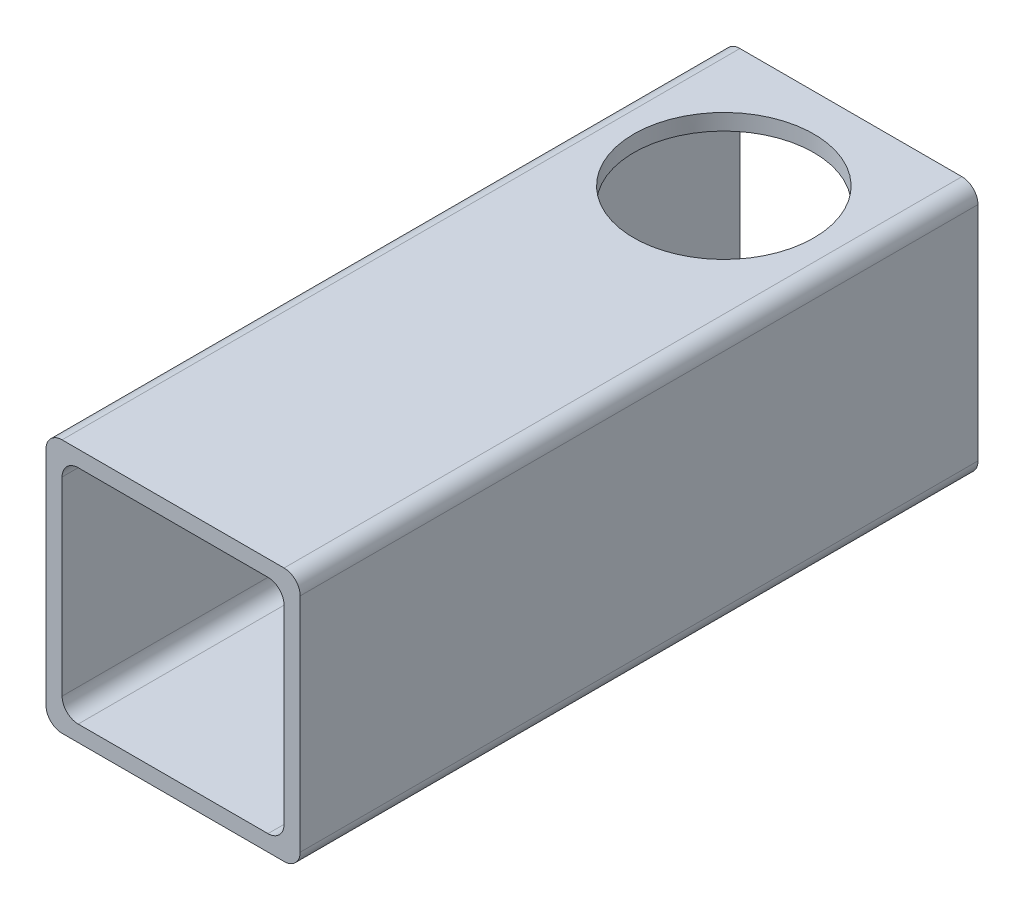
ISO-10303-21;
HEADER;
FILE_DESCRIPTION(('STEP AP214'),'2;1');
FILE_NAME('part.step','',(''),(''),'','','');
FILE_SCHEMA(('AUTOMOTIVE_DESIGN { 1 0 10303 214 1 1 1 1 }'));
ENDSEC;
DATA;
#1=APPLICATION_CONTEXT('core data for automotive mechanical design processes');
#2=APPLICATION_PROTOCOL_DEFINITION('international standard','automotive_design',2000,#1);
#3=PRODUCT_CONTEXT('',#1,'mechanical');
#4=PRODUCT('Part','Part','',(#3));
#5=PRODUCT_RELATED_PRODUCT_CATEGORY('part','',(#4));
#6=PRODUCT_DEFINITION_FORMATION('','',#4);
#7=PRODUCT_DEFINITION_CONTEXT('part definition',#1,'design');
#8=PRODUCT_DEFINITION('design','',#6,#7);
#9=PRODUCT_DEFINITION_SHAPE('','',#8);
#10=(LENGTH_UNIT() NAMED_UNIT(*) SI_UNIT(.MILLI.,.METRE.));
#11=(NAMED_UNIT(*) PLANE_ANGLE_UNIT() SI_UNIT($,.RADIAN.));
#12=(NAMED_UNIT(*) SI_UNIT($,.STERADIAN.) SOLID_ANGLE_UNIT());
#13=UNCERTAINTY_MEASURE_WITH_UNIT(LENGTH_MEASURE(1.E-05),#10,'distance_accuracy_value','');
#14=(GEOMETRIC_REPRESENTATION_CONTEXT(3) GLOBAL_UNCERTAINTY_ASSIGNED_CONTEXT((#13)) GLOBAL_UNIT_ASSIGNED_CONTEXT((#10,
#11,#12)) REPRESENTATION_CONTEXT('',''));
#15=CARTESIAN_POINT('',(0.,0.,0.));
#16=DIRECTION('',(0.,0.,1.));
#17=DIRECTION('',(1.,0.,0.));
#18=AXIS2_PLACEMENT_3D('',#15,#16,#17);
#19=CARTESIAN_POINT('',(16.637,16.637,101.6));
#20=DIRECTION('',(0.,0.,1.));
#21=DIRECTION('',(1.,0.,0.));
#22=AXIS2_PLACEMENT_3D('',#19,#20,#21);
#23=PLANE('',#22);
#24=CARTESIAN_POINT('',(16.637,16.637,101.6));
#25=DIRECTION('',(0.,0.,1.));
#26=DIRECTION('',(1.,0.,0.));
#27=AXIS2_PLACEMENT_3D('',#24,#25,#26);
#28=CIRCLE('',#27,2.413);
#29=CARTESIAN_POINT('',(19.05,16.637,101.6));
#30=VERTEX_POINT('',#29);
#31=CARTESIAN_POINT('',(16.637,19.05,101.6));
#32=VERTEX_POINT('',#31);
#33=EDGE_CURVE('E227',#30,#32,#28,.T.);
#34=ORIENTED_EDGE('',*,*,#33,.T.);
#35=DIRECTION('',(-1.,0.,0.));
#36=VECTOR('',#35,1.);
#37=CARTESIAN_POINT('',(16.637,19.05,101.6));
#38=LINE('',#37,#36);
#39=CARTESIAN_POINT('',(-16.637,19.05,101.6));
#40=VERTEX_POINT('',#39);
#41=EDGE_CURVE('E230',#32,#40,#38,.T.);
#42=ORIENTED_EDGE('',*,*,#41,.T.);
#43=CARTESIAN_POINT('',(-16.637,16.637,101.6));
#44=DIRECTION('',(0.,0.,1.));
#45=DIRECTION('',(1.,0.,0.));
#46=AXIS2_PLACEMENT_3D('',#43,#44,#45);
#47=CIRCLE('',#46,2.413);
#48=CARTESIAN_POINT('',(-19.05,16.637,101.6));
#49=VERTEX_POINT('',#48);
#50=EDGE_CURVE('E233',#40,#49,#47,.T.);
#51=ORIENTED_EDGE('',*,*,#50,.T.);
#52=DIRECTION('',(0.,-1.,0.));
#53=VECTOR('',#52,1.);
#54=CARTESIAN_POINT('',(-19.05,-16.637,101.6));
#55=LINE('',#54,#53);
#56=CARTESIAN_POINT('',(-19.05,-16.637,101.6));
#57=VERTEX_POINT('',#56);
#58=EDGE_CURVE('E235',#49,#57,#55,.T.);
#59=ORIENTED_EDGE('',*,*,#58,.T.);
#60=CARTESIAN_POINT('',(-16.637,-16.637,101.6));
#61=DIRECTION('',(0.,0.,1.));
#62=DIRECTION('',(1.,0.,0.));
#63=AXIS2_PLACEMENT_3D('',#60,#61,#62);
#64=CIRCLE('',#63,2.413);
#65=CARTESIAN_POINT('',(-16.637,-19.05,101.6));
#66=VERTEX_POINT('',#65);
#67=EDGE_CURVE('E237',#57,#66,#64,.T.);
#68=ORIENTED_EDGE('',*,*,#67,.T.);
#69=DIRECTION('',(1.,0.,0.));
#70=VECTOR('',#69,1.);
#71=CARTESIAN_POINT('',(-16.637,-19.05,101.6));
#72=LINE('',#71,#70);
#73=CARTESIAN_POINT('',(16.637,-19.05,101.6));
#74=VERTEX_POINT('',#73);
#75=EDGE_CURVE('E239',#66,#74,#72,.T.);
#76=ORIENTED_EDGE('',*,*,#75,.T.);
#77=CARTESIAN_POINT('',(16.637,-16.637,101.6));
#78=DIRECTION('',(0.,0.,1.));
#79=DIRECTION('',(1.,0.,0.));
#80=AXIS2_PLACEMENT_3D('',#77,#78,#79);
#81=CIRCLE('',#80,2.413);
#82=CARTESIAN_POINT('',(19.05,-16.637,101.6));
#83=VERTEX_POINT('',#82);
#84=EDGE_CURVE('E241',#74,#83,#81,.T.);
#85=ORIENTED_EDGE('',*,*,#84,.T.);
#86=DIRECTION('',(0.,1.,0.));
#87=VECTOR('',#86,1.);
#88=CARTESIAN_POINT('',(19.05,16.637,101.6));
#89=LINE('',#88,#87);
#90=EDGE_CURVE('E243',#83,#30,#89,.T.);
#91=ORIENTED_EDGE('',*,*,#90,.T.);
#92=EDGE_LOOP('',(#34,#42,#51,#59,#68,#76,#85,#91));
#93=FACE_BOUND('',#92,.T.);
#94=DIRECTION('',(0.,-1.,0.));
#95=VECTOR('',#94,1.);
#96=CARTESIAN_POINT('',(-16.637,-14.224,101.6));
#97=LINE('',#96,#95);
#98=CARTESIAN_POINT('',(-16.637,14.224,101.6));
#99=VERTEX_POINT('',#98);
#100=CARTESIAN_POINT('',(-16.637,-14.224,101.6));
#101=VERTEX_POINT('',#100);
#102=EDGE_CURVE('E162',#99,#101,#97,.T.);
#103=ORIENTED_EDGE('',*,*,#102,.F.);
#104=CARTESIAN_POINT('',(-14.224,14.224,101.6));
#105=DIRECTION('',(0.,0.,1.));
#106=DIRECTION('',(1.,0.,0.));
#107=AXIS2_PLACEMENT_3D('',#104,#105,#106);
#108=CIRCLE('',#107,2.41299999999999);
#109=CARTESIAN_POINT('',(-14.224,16.637,101.6));
#110=VERTEX_POINT('',#109);
#111=EDGE_CURVE('E154',#110,#99,#108,.T.);
#112=ORIENTED_EDGE('',*,*,#111,.F.);
#113=DIRECTION('',(-1.,0.,0.));
#114=VECTOR('',#113,1.);
#115=CARTESIAN_POINT('',(14.224,16.637,101.6));
#116=LINE('',#115,#114);
#117=CARTESIAN_POINT('',(14.224,16.637,101.6));
#118=VERTEX_POINT('',#117);
#119=EDGE_CURVE('E189',#118,#110,#116,.T.);
#120=ORIENTED_EDGE('',*,*,#119,.F.);
#121=CARTESIAN_POINT('',(14.224,14.224,101.6));
#122=DIRECTION('',(0.,0.,1.));
#123=DIRECTION('',(1.,0.,0.));
#124=AXIS2_PLACEMENT_3D('',#121,#122,#123);
#125=CIRCLE('',#124,2.41299999999999);
#126=CARTESIAN_POINT('',(16.637,14.224,101.6));
#127=VERTEX_POINT('',#126);
#128=EDGE_CURVE('E187',#127,#118,#125,.T.);
#129=ORIENTED_EDGE('',*,*,#128,.F.);
#130=DIRECTION('',(0.,1.,0.));
#131=VECTOR('',#130,1.);
#132=CARTESIAN_POINT('',(16.637,14.224,101.6));
#133=LINE('',#132,#131);
#134=CARTESIAN_POINT('',(16.637,-14.224,101.6));
#135=VERTEX_POINT('',#134);
#136=EDGE_CURVE('E185',#135,#127,#133,.T.);
#137=ORIENTED_EDGE('',*,*,#136,.F.);
#138=CARTESIAN_POINT('',(14.224,-14.224,101.6));
#139=DIRECTION('',(0.,0.,1.));
#140=DIRECTION('',(1.,0.,0.));
#141=AXIS2_PLACEMENT_3D('',#138,#139,#140);
#142=CIRCLE('',#141,2.41299999999999);
#143=CARTESIAN_POINT('',(14.224,-16.637,101.6));
#144=VERTEX_POINT('',#143);
#145=EDGE_CURVE('E183',#144,#135,#142,.T.);
#146=ORIENTED_EDGE('',*,*,#145,.F.);
#147=DIRECTION('',(1.,0.,0.));
#148=VECTOR('',#147,1.);
#149=CARTESIAN_POINT('',(-14.224,-16.637,101.6));
#150=LINE('',#149,#148);
#151=CARTESIAN_POINT('',(-14.224,-16.637,101.6));
#152=VERTEX_POINT('',#151);
#153=EDGE_CURVE('E178',#152,#144,#150,.T.);
#154=ORIENTED_EDGE('',*,*,#153,.F.);
#155=CARTESIAN_POINT('',(-14.224,-14.224,101.6));
#156=DIRECTION('',(0.,0.,1.));
#157=DIRECTION('',(1.,0.,0.));
#158=AXIS2_PLACEMENT_3D('',#155,#156,#157);
#159=CIRCLE('',#158,2.41299999999999);
#160=EDGE_CURVE('E176',#101,#152,#159,.T.);
#161=ORIENTED_EDGE('',*,*,#160,.F.);
#162=EDGE_LOOP('',(#103,#112,#120,#129,#137,#146,#154,#161));
#163=FACE_BOUND('',#162,.T.);
#164=ADVANCED_FACE('F39',(#93,#163),#23,.T.);
#165=CARTESIAN_POINT('',(16.637,16.637,0.));
#166=DIRECTION('',(0.,0.,1.));
#167=DIRECTION('',(1.,0.,0.));
#168=AXIS2_PLACEMENT_3D('',#165,#166,#167);
#169=PLANE('',#168);
#170=CARTESIAN_POINT('',(16.637,16.637,0.));
#171=DIRECTION('',(0.,0.,1.));
#172=DIRECTION('',(1.,0.,0.));
#173=AXIS2_PLACEMENT_3D('',#170,#171,#172);
#174=CIRCLE('',#173,2.413);
#175=CARTESIAN_POINT('',(19.05,16.637,0.));
#176=VERTEX_POINT('',#175);
#177=CARTESIAN_POINT('',(16.637,19.05,0.));
#178=VERTEX_POINT('',#177);
#179=EDGE_CURVE('E171',#176,#178,#174,.T.);
#180=ORIENTED_EDGE('',*,*,#179,.F.);
#181=DIRECTION('',(0.,1.,0.));
#182=VECTOR('',#181,1.);
#183=CARTESIAN_POINT('',(19.05,16.637,0.));
#184=LINE('',#183,#182);
#185=CARTESIAN_POINT('',(19.05,-16.637,0.));
#186=VERTEX_POINT('',#185);
#187=EDGE_CURVE('E231',#186,#176,#184,.T.);
#188=ORIENTED_EDGE('',*,*,#187,.F.);
#189=CARTESIAN_POINT('',(16.637,-16.637,0.));
#190=DIRECTION('',(0.,0.,1.));
#191=DIRECTION('',(1.,0.,0.));
#192=AXIS2_PLACEMENT_3D('',#189,#190,#191);
#193=CIRCLE('',#192,2.413);
#194=CARTESIAN_POINT('',(16.637,-19.05,0.));
#195=VERTEX_POINT('',#194);
#196=EDGE_CURVE('E258',#195,#186,#193,.T.);
#197=ORIENTED_EDGE('',*,*,#196,.F.);
#198=DIRECTION('',(1.,0.,0.));
#199=VECTOR('',#198,1.);
#200=CARTESIAN_POINT('',(-16.637,-19.05,0.));
#201=LINE('',#200,#199);
#202=CARTESIAN_POINT('',(-16.637,-19.05,0.));
#203=VERTEX_POINT('',#202);
#204=EDGE_CURVE('E256',#203,#195,#201,.T.);
#205=ORIENTED_EDGE('',*,*,#204,.F.);
#206=CARTESIAN_POINT('',(-16.637,-16.637,0.));
#207=DIRECTION('',(0.,0.,1.));
#208=DIRECTION('',(1.,0.,0.));
#209=AXIS2_PLACEMENT_3D('',#206,#207,#208);
#210=CIRCLE('',#209,2.413);
#211=CARTESIAN_POINT('',(-19.05,-16.637,0.));
#212=VERTEX_POINT('',#211);
#213=EDGE_CURVE('E254',#212,#203,#210,.T.);
#214=ORIENTED_EDGE('',*,*,#213,.F.);
#215=DIRECTION('',(0.,-1.,0.));
#216=VECTOR('',#215,1.);
#217=CARTESIAN_POINT('',(-19.05,-16.637,0.));
#218=LINE('',#217,#216);
#219=CARTESIAN_POINT('',(-19.05,16.637,0.));
#220=VERTEX_POINT('',#219);
#221=EDGE_CURVE('E252',#220,#212,#218,.T.);
#222=ORIENTED_EDGE('',*,*,#221,.F.);
#223=CARTESIAN_POINT('',(-16.637,16.637,0.));
#224=DIRECTION('',(0.,0.,1.));
#225=DIRECTION('',(1.,0.,0.));
#226=AXIS2_PLACEMENT_3D('',#223,#224,#225);
#227=CIRCLE('',#226,2.413);
#228=CARTESIAN_POINT('',(-16.637,19.05,0.));
#229=VERTEX_POINT('',#228);
#230=EDGE_CURVE('E250',#229,#220,#227,.T.);
#231=ORIENTED_EDGE('',*,*,#230,.F.);
#232=DIRECTION('',(-1.,0.,0.));
#233=VECTOR('',#232,1.);
#234=CARTESIAN_POINT('',(16.637,19.05,0.));
#235=LINE('',#234,#233);
#236=EDGE_CURVE('E248',#178,#229,#235,.T.);
#237=ORIENTED_EDGE('',*,*,#236,.F.);
#238=EDGE_LOOP('',(#180,#188,#197,#205,#214,#222,#231,#237));
#239=FACE_BOUND('',#238,.T.);
#240=CARTESIAN_POINT('',(-14.224,14.224,0.));
#241=DIRECTION('',(0.,0.,1.));
#242=DIRECTION('',(1.,0.,0.));
#243=AXIS2_PLACEMENT_3D('',#240,#241,#242);
#244=CIRCLE('',#243,2.41299999999999);
#245=CARTESIAN_POINT('',(-14.224,16.637,0.));
#246=VERTEX_POINT('',#245);
#247=CARTESIAN_POINT('',(-16.637,14.224,0.));
#248=VERTEX_POINT('',#247);
#249=EDGE_CURVE('E64',#246,#248,#244,.T.);
#250=ORIENTED_EDGE('',*,*,#249,.T.);
#251=DIRECTION('',(0.,-1.,0.));
#252=VECTOR('',#251,1.);
#253=CARTESIAN_POINT('',(-16.637,-14.224,0.));
#254=LINE('',#253,#252);
#255=CARTESIAN_POINT('',(-16.637,-14.224,0.));
#256=VERTEX_POINT('',#255);
#257=EDGE_CURVE('E169',#248,#256,#254,.T.);
#258=ORIENTED_EDGE('',*,*,#257,.T.);
#259=CARTESIAN_POINT('',(-14.224,-14.224,0.));
#260=DIRECTION('',(0.,0.,1.));
#261=DIRECTION('',(1.,0.,0.));
#262=AXIS2_PLACEMENT_3D('',#259,#260,#261);
#263=CIRCLE('',#262,2.41299999999999);
#264=CARTESIAN_POINT('',(-14.224,-16.637,0.));
#265=VERTEX_POINT('',#264);
#266=EDGE_CURVE('E194',#256,#265,#263,.T.);
#267=ORIENTED_EDGE('',*,*,#266,.T.);
#268=DIRECTION('',(1.,0.,0.));
#269=VECTOR('',#268,1.);
#270=CARTESIAN_POINT('',(-14.224,-16.637,0.));
#271=LINE('',#270,#269);
#272=CARTESIAN_POINT('',(14.224,-16.637,0.));
#273=VERTEX_POINT('',#272);
#274=EDGE_CURVE('E197',#265,#273,#271,.T.);
#275=ORIENTED_EDGE('',*,*,#274,.T.);
#276=CARTESIAN_POINT('',(14.224,-14.224,0.));
#277=DIRECTION('',(0.,0.,1.));
#278=DIRECTION('',(1.,0.,0.));
#279=AXIS2_PLACEMENT_3D('',#276,#277,#278);
#280=CIRCLE('',#279,2.41299999999999);
#281=CARTESIAN_POINT('',(16.637,-14.224,0.));
#282=VERTEX_POINT('',#281);
#283=EDGE_CURVE('E200',#273,#282,#280,.T.);
#284=ORIENTED_EDGE('',*,*,#283,.T.);
#285=DIRECTION('',(0.,1.,0.));
#286=VECTOR('',#285,1.);
#287=CARTESIAN_POINT('',(16.637,14.224,0.));
#288=LINE('',#287,#286);
#289=CARTESIAN_POINT('',(16.637,14.224,0.));
#290=VERTEX_POINT('',#289);
#291=EDGE_CURVE('E203',#282,#290,#288,.T.);
#292=ORIENTED_EDGE('',*,*,#291,.T.);
#293=CARTESIAN_POINT('',(14.224,14.224,0.));
#294=DIRECTION('',(0.,0.,1.));
#295=DIRECTION('',(1.,0.,0.));
#296=AXIS2_PLACEMENT_3D('',#293,#294,#295);
#297=CIRCLE('',#296,2.41299999999999);
#298=CARTESIAN_POINT('',(14.224,16.637,0.));
#299=VERTEX_POINT('',#298);
#300=EDGE_CURVE('E206',#290,#299,#297,.T.);
#301=ORIENTED_EDGE('',*,*,#300,.T.);
#302=DIRECTION('',(-1.,0.,0.));
#303=VECTOR('',#302,1.);
#304=CARTESIAN_POINT('',(14.224,16.637,0.));
#305=LINE('',#304,#303);
#306=EDGE_CURVE('E163',#299,#246,#305,.T.);
#307=ORIENTED_EDGE('',*,*,#306,.T.);
#308=EDGE_LOOP('',(#250,#258,#267,#275,#284,#292,#301,#307));
#309=FACE_BOUND('',#308,.T.);
#310=ADVANCED_FACE('F292',(#239,#309),#169,.F.);
#311=CARTESIAN_POINT('',(16.637,16.637,101.6));
#312=DIRECTION('',(0.,0.,-1.));
#313=DIRECTION('',(-1.,0.,0.));
#314=AXIS2_PLACEMENT_3D('',#311,#312,#313);
#315=CYLINDRICAL_SURFACE('',#314,2.413);
#316=ORIENTED_EDGE('',*,*,#179,.T.);
#317=DIRECTION('',(0.,0.,-1.));
#318=VECTOR('',#317,1.);
#319=CARTESIAN_POINT('',(16.637,19.05,101.6));
#320=LINE('',#319,#318);
#321=EDGE_CURVE('E11',#32,#178,#320,.T.);
#322=ORIENTED_EDGE('',*,*,#321,.F.);
#323=ORIENTED_EDGE('',*,*,#33,.F.);
#324=DIRECTION('',(0.,0.,-1.));
#325=VECTOR('',#324,1.);
#326=CARTESIAN_POINT('',(19.05,16.637,101.6));
#327=LINE('',#326,#325);
#328=EDGE_CURVE('E245',#30,#176,#327,.T.);
#329=ORIENTED_EDGE('',*,*,#328,.T.);
#330=EDGE_LOOP('',(#316,#322,#323,#329));
#331=FACE_BOUND('',#330,.T.);
#332=ADVANCED_FACE('F41',(#331),#315,.T.);
#333=CARTESIAN_POINT('',(16.637,19.05,101.6));
#334=DIRECTION('',(0.,-1.,0.));
#335=DIRECTION('',(1.,0.,0.));
#336=AXIS2_PLACEMENT_3D('',#333,#334,#335);
#337=PLANE('',#336);
#338=CARTESIAN_POINT('',(0.,19.05,19.05));
#339=DIRECTION('',(0.,-1.,0.));
#340=DIRECTION('',(1.,0.,0.));
#341=AXIS2_PLACEMENT_3D('',#338,#339,#340);
#342=CIRCLE('',#341,13.49375);
#343=CARTESIAN_POINT('',(13.49375,19.05,19.05));
#344=VERTEX_POINT('',#343);
#345=EDGE_CURVE('E192',#344,#344,#342,.T.);
#346=ORIENTED_EDGE('',*,*,#345,.T.);
#347=EDGE_LOOP('',(#346));
#348=FACE_BOUND('',#347,.T.);
#349=ORIENTED_EDGE('',*,*,#236,.T.);
#350=DIRECTION('',(0.,0.,-1.));
#351=VECTOR('',#350,1.);
#352=CARTESIAN_POINT('',(-16.637,19.05,101.6));
#353=LINE('',#352,#351);
#354=EDGE_CURVE('E49',#40,#229,#353,.T.);
#355=ORIENTED_EDGE('',*,*,#354,.F.);
#356=ORIENTED_EDGE('',*,*,#41,.F.);
#357=ORIENTED_EDGE('',*,*,#321,.T.);
#358=EDGE_LOOP('',(#349,#355,#356,#357));
#359=FACE_BOUND('',#358,.T.);
#360=ADVANCED_FACE('F309',(#348,#359),#337,.F.);
#361=CARTESIAN_POINT('',(-16.637,16.637,101.6));
#362=DIRECTION('',(0.,0.,-1.));
#363=DIRECTION('',(-1.,0.,0.));
#364=AXIS2_PLACEMENT_3D('',#361,#362,#363);
#365=CYLINDRICAL_SURFACE('',#364,2.413);
#366=ORIENTED_EDGE('',*,*,#230,.T.);
#367=DIRECTION('',(0.,0.,-1.));
#368=VECTOR('',#367,1.);
#369=CARTESIAN_POINT('',(-19.05,16.637,101.6));
#370=LINE('',#369,#368);
#371=EDGE_CURVE('E278',#49,#220,#370,.T.);
#372=ORIENTED_EDGE('',*,*,#371,.F.);
#373=ORIENTED_EDGE('',*,*,#50,.F.);
#374=ORIENTED_EDGE('',*,*,#354,.T.);
#375=EDGE_LOOP('',(#366,#372,#373,#374));
#376=FACE_BOUND('',#375,.T.);
#377=ADVANCED_FACE('F286',(#376),#365,.T.);
#378=CARTESIAN_POINT('',(-19.05,-16.637,101.6));
#379=DIRECTION('',(1.,0.,0.));
#380=DIRECTION('',(0.,1.,0.));
#381=AXIS2_PLACEMENT_3D('',#378,#379,#380);
#382=PLANE('',#381);
#383=ORIENTED_EDGE('',*,*,#221,.T.);
#384=DIRECTION('',(0.,0.,-1.));
#385=VECTOR('',#384,1.);
#386=CARTESIAN_POINT('',(-19.05,-16.637,101.6));
#387=LINE('',#386,#385);
#388=EDGE_CURVE('E274',#57,#212,#387,.T.);
#389=ORIENTED_EDGE('',*,*,#388,.F.);
#390=ORIENTED_EDGE('',*,*,#58,.F.);
#391=ORIENTED_EDGE('',*,*,#371,.T.);
#392=EDGE_LOOP('',(#383,#389,#390,#391));
#393=FACE_BOUND('',#392,.T.);
#394=ADVANCED_FACE('F298',(#393),#382,.F.);
#395=CARTESIAN_POINT('',(-16.637,-16.637,101.6));
#396=DIRECTION('',(0.,0.,-1.));
#397=DIRECTION('',(-1.,0.,0.));
#398=AXIS2_PLACEMENT_3D('',#395,#396,#397);
#399=CYLINDRICAL_SURFACE('',#398,2.413);
#400=ORIENTED_EDGE('',*,*,#213,.T.);
#401=DIRECTION('',(0.,0.,-1.));
#402=VECTOR('',#401,1.);
#403=CARTESIAN_POINT('',(-16.637,-19.05,101.6));
#404=LINE('',#403,#402);
#405=EDGE_CURVE('E270',#66,#203,#404,.T.);
#406=ORIENTED_EDGE('',*,*,#405,.F.);
#407=ORIENTED_EDGE('',*,*,#67,.F.);
#408=ORIENTED_EDGE('',*,*,#388,.T.);
#409=EDGE_LOOP('',(#400,#406,#407,#408));
#410=FACE_BOUND('',#409,.T.);
#411=ADVANCED_FACE('F302',(#410),#399,.T.);
#412=CARTESIAN_POINT('',(-16.637,-19.05,101.6));
#413=DIRECTION('',(0.,1.,0.));
#414=DIRECTION('',(-1.,0.,0.));
#415=AXIS2_PLACEMENT_3D('',#412,#413,#414);
#416=PLANE('',#415);
#417=CARTESIAN_POINT('',(0.,-19.05,19.05));
#418=DIRECTION('',(0.,1.,0.));
#419=DIRECTION('',(-1.,0.,0.));
#420=AXIS2_PLACEMENT_3D('',#417,#418,#419);
#421=CIRCLE('',#420,13.49375);
#422=CARTESIAN_POINT('',(-13.49375,-19.05,19.05));
#423=VERTEX_POINT('',#422);
#424=EDGE_CURVE('E391',#423,#423,#421,.T.);
#425=ORIENTED_EDGE('',*,*,#424,.T.);
#426=EDGE_LOOP('',(#425));
#427=FACE_BOUND('',#426,.T.);
#428=ORIENTED_EDGE('',*,*,#204,.T.);
#429=DIRECTION('',(0.,0.,-1.));
#430=VECTOR('',#429,1.);
#431=CARTESIAN_POINT('',(16.637,-19.05,101.6));
#432=LINE('',#431,#430);
#433=EDGE_CURVE('E267',#74,#195,#432,.T.);
#434=ORIENTED_EDGE('',*,*,#433,.F.);
#435=ORIENTED_EDGE('',*,*,#75,.F.);
#436=ORIENTED_EDGE('',*,*,#405,.T.);
#437=EDGE_LOOP('',(#428,#434,#435,#436));
#438=FACE_BOUND('',#437,.T.);
#439=ADVANCED_FACE('F322',(#427,#438),#416,.F.);
#440=CARTESIAN_POINT('',(16.637,-16.637,101.6));
#441=DIRECTION('',(0.,0.,-1.));
#442=DIRECTION('',(-1.,0.,0.));
#443=AXIS2_PLACEMENT_3D('',#440,#441,#442);
#444=CYLINDRICAL_SURFACE('',#443,2.413);
#445=ORIENTED_EDGE('',*,*,#196,.T.);
#446=DIRECTION('',(0.,0.,-1.));
#447=VECTOR('',#446,1.);
#448=CARTESIAN_POINT('',(19.05,-16.637,101.6));
#449=LINE('',#448,#447);
#450=EDGE_CURVE('E264',#83,#186,#449,.T.);
#451=ORIENTED_EDGE('',*,*,#450,.F.);
#452=ORIENTED_EDGE('',*,*,#84,.F.);
#453=ORIENTED_EDGE('',*,*,#433,.T.);
#454=EDGE_LOOP('',(#445,#451,#452,#453));
#455=FACE_BOUND('',#454,.T.);
#456=ADVANCED_FACE('F320',(#455),#444,.T.);
#457=CARTESIAN_POINT('',(19.05,16.637,101.6));
#458=DIRECTION('',(-1.,0.,0.));
#459=DIRECTION('',(0.,-1.,0.));
#460=AXIS2_PLACEMENT_3D('',#457,#458,#459);
#461=PLANE('',#460);
#462=ORIENTED_EDGE('',*,*,#187,.T.);
#463=ORIENTED_EDGE('',*,*,#328,.F.);
#464=ORIENTED_EDGE('',*,*,#90,.F.);
#465=ORIENTED_EDGE('',*,*,#450,.T.);
#466=EDGE_LOOP('',(#462,#463,#464,#465));
#467=FACE_BOUND('',#466,.T.);
#468=ADVANCED_FACE('F315',(#467),#461,.F.);
#469=CARTESIAN_POINT('',(-14.224,14.224,101.6));
#470=DIRECTION('',(0.,0.,-1.));
#471=DIRECTION('',(-1.,0.,0.));
#472=AXIS2_PLACEMENT_3D('',#469,#470,#471);
#473=CYLINDRICAL_SURFACE('',#472,2.41299999999999);
#474=ORIENTED_EDGE('',*,*,#249,.F.);
#475=DIRECTION('',(0.,0.,-1.));
#476=VECTOR('',#475,1.);
#477=CARTESIAN_POINT('',(-14.224,16.637,101.6));
#478=LINE('',#477,#476);
#479=EDGE_CURVE('E158',#110,#246,#478,.T.);
#480=ORIENTED_EDGE('',*,*,#479,.F.);
#481=ORIENTED_EDGE('',*,*,#111,.T.);
#482=DIRECTION('',(0.,0.,-1.));
#483=VECTOR('',#482,1.);
#484=CARTESIAN_POINT('',(-16.637,14.224,101.6));
#485=LINE('',#484,#483);
#486=EDGE_CURVE('E157',#99,#248,#485,.T.);
#487=ORIENTED_EDGE('',*,*,#486,.T.);
#488=EDGE_LOOP('',(#474,#480,#481,#487));
#489=FACE_BOUND('',#488,.T.);
#490=ADVANCED_FACE('F156',(#489),#473,.F.);
#491=CARTESIAN_POINT('',(-16.637,-14.224,101.6));
#492=DIRECTION('',(1.,0.,0.));
#493=DIRECTION('',(0.,0.,-1.));
#494=AXIS2_PLACEMENT_3D('',#491,#492,#493);
#495=PLANE('',#494);
#496=ORIENTED_EDGE('',*,*,#257,.F.);
#497=ORIENTED_EDGE('',*,*,#486,.F.);
#498=ORIENTED_EDGE('',*,*,#102,.T.);
#499=DIRECTION('',(0.,0.,-1.));
#500=VECTOR('',#499,1.);
#501=CARTESIAN_POINT('',(-16.637,-14.224,101.6));
#502=LINE('',#501,#500);
#503=EDGE_CURVE('E172',#101,#256,#502,.T.);
#504=ORIENTED_EDGE('',*,*,#503,.T.);
#505=EDGE_LOOP('',(#496,#497,#498,#504));
#506=FACE_BOUND('',#505,.T.);
#507=ADVANCED_FACE('F166',(#506),#495,.T.);
#508=CARTESIAN_POINT('',(-14.224,-14.224,101.6));
#509=DIRECTION('',(0.,0.,-1.));
#510=DIRECTION('',(-1.,0.,0.));
#511=AXIS2_PLACEMENT_3D('',#508,#509,#510);
#512=CYLINDRICAL_SURFACE('',#511,2.41299999999999);
#513=ORIENTED_EDGE('',*,*,#266,.F.);
#514=ORIENTED_EDGE('',*,*,#503,.F.);
#515=ORIENTED_EDGE('',*,*,#160,.T.);
#516=DIRECTION('',(0.,0.,-1.));
#517=VECTOR('',#516,1.);
#518=CARTESIAN_POINT('',(-14.224,-16.637,101.6));
#519=LINE('',#518,#517);
#520=EDGE_CURVE('E222',#152,#265,#519,.T.);
#521=ORIENTED_EDGE('',*,*,#520,.T.);
#522=EDGE_LOOP('',(#513,#514,#515,#521));
#523=FACE_BOUND('',#522,.T.);
#524=ADVANCED_FACE('F349',(#523),#512,.F.);
#525=CARTESIAN_POINT('',(-14.224,-16.637,101.6));
#526=DIRECTION('',(0.,1.,0.));
#527=DIRECTION('',(0.,0.,1.));
#528=AXIS2_PLACEMENT_3D('',#525,#526,#527);
#529=PLANE('',#528);
#530=CARTESIAN_POINT('',(0.,-16.637,19.05));
#531=DIRECTION('',(0.,1.,0.));
#532=DIRECTION('',(0.,0.,1.));
#533=AXIS2_PLACEMENT_3D('',#530,#531,#532);
#534=CIRCLE('',#533,13.49375);
#535=CARTESIAN_POINT('',(0.,-16.637,32.54375));
#536=VERTEX_POINT('',#535);
#537=EDGE_CURVE('E393',#536,#536,#534,.T.);
#538=ORIENTED_EDGE('',*,*,#537,.F.);
#539=EDGE_LOOP('',(#538));
#540=FACE_BOUND('',#539,.T.);
#541=ORIENTED_EDGE('',*,*,#274,.F.);
#542=ORIENTED_EDGE('',*,*,#520,.F.);
#543=ORIENTED_EDGE('',*,*,#153,.T.);
#544=DIRECTION('',(0.,0.,-1.));
#545=VECTOR('',#544,1.);
#546=CARTESIAN_POINT('',(14.224,-16.637,101.6));
#547=LINE('',#546,#545);
#548=EDGE_CURVE('E220',#144,#273,#547,.T.);
#549=ORIENTED_EDGE('',*,*,#548,.T.);
#550=EDGE_LOOP('',(#541,#542,#543,#549));
#551=FACE_BOUND('',#550,.T.);
#552=ADVANCED_FACE('F353',(#540,#551),#529,.T.);
#553=CARTESIAN_POINT('',(14.224,-14.224,101.6));
#554=DIRECTION('',(0.,0.,-1.));
#555=DIRECTION('',(-1.,0.,0.));
#556=AXIS2_PLACEMENT_3D('',#553,#554,#555);
#557=CYLINDRICAL_SURFACE('',#556,2.41299999999999);
#558=ORIENTED_EDGE('',*,*,#283,.F.);
#559=ORIENTED_EDGE('',*,*,#548,.F.);
#560=ORIENTED_EDGE('',*,*,#145,.T.);
#561=DIRECTION('',(0.,0.,-1.));
#562=VECTOR('',#561,1.);
#563=CARTESIAN_POINT('',(16.637,-14.224,101.6));
#564=LINE('',#563,#562);
#565=EDGE_CURVE('E218',#135,#282,#564,.T.);
#566=ORIENTED_EDGE('',*,*,#565,.T.);
#567=EDGE_LOOP('',(#558,#559,#560,#566));
#568=FACE_BOUND('',#567,.T.);
#569=ADVANCED_FACE('F359',(#568),#557,.F.);
#570=CARTESIAN_POINT('',(16.637,14.224,101.6));
#571=DIRECTION('',(-1.,0.,0.));
#572=DIRECTION('',(0.,0.,1.));
#573=AXIS2_PLACEMENT_3D('',#570,#571,#572);
#574=PLANE('',#573);
#575=ORIENTED_EDGE('',*,*,#291,.F.);
#576=ORIENTED_EDGE('',*,*,#565,.F.);
#577=ORIENTED_EDGE('',*,*,#136,.T.);
#578=DIRECTION('',(0.,0.,-1.));
#579=VECTOR('',#578,1.);
#580=CARTESIAN_POINT('',(16.637,14.224,101.6));
#581=LINE('',#580,#579);
#582=EDGE_CURVE('E215',#127,#290,#581,.T.);
#583=ORIENTED_EDGE('',*,*,#582,.T.);
#584=EDGE_LOOP('',(#575,#576,#577,#583));
#585=FACE_BOUND('',#584,.T.);
#586=ADVANCED_FACE('F363',(#585),#574,.T.);
#587=CARTESIAN_POINT('',(14.224,14.224,101.6));
#588=DIRECTION('',(0.,0.,-1.));
#589=DIRECTION('',(-1.,0.,0.));
#590=AXIS2_PLACEMENT_3D('',#587,#588,#589);
#591=CYLINDRICAL_SURFACE('',#590,2.41299999999999);
#592=ORIENTED_EDGE('',*,*,#300,.F.);
#593=ORIENTED_EDGE('',*,*,#582,.F.);
#594=ORIENTED_EDGE('',*,*,#128,.T.);
#595=DIRECTION('',(0.,0.,-1.));
#596=VECTOR('',#595,1.);
#597=CARTESIAN_POINT('',(14.224,16.637,101.6));
#598=LINE('',#597,#596);
#599=EDGE_CURVE('E56',#118,#299,#598,.T.);
#600=ORIENTED_EDGE('',*,*,#599,.T.);
#601=EDGE_LOOP('',(#592,#593,#594,#600));
#602=FACE_BOUND('',#601,.T.);
#603=ADVANCED_FACE('F367',(#602),#591,.F.);
#604=CARTESIAN_POINT('',(14.224,16.637,101.6));
#605=DIRECTION('',(0.,-1.,0.));
#606=DIRECTION('',(0.,0.,-1.));
#607=AXIS2_PLACEMENT_3D('',#604,#605,#606);
#608=PLANE('',#607);
#609=CARTESIAN_POINT('',(0.,16.637,19.05));
#610=DIRECTION('',(0.,-1.,0.));
#611=DIRECTION('',(0.,0.,-1.));
#612=AXIS2_PLACEMENT_3D('',#609,#610,#611);
#613=CIRCLE('',#612,13.49375);
#614=CARTESIAN_POINT('',(0.,16.637,5.55625));
#615=VERTEX_POINT('',#614);
#616=EDGE_CURVE('E43',#615,#615,#613,.T.);
#617=ORIENTED_EDGE('',*,*,#616,.F.);
#618=EDGE_LOOP('',(#617));
#619=FACE_BOUND('',#618,.T.);
#620=ORIENTED_EDGE('',*,*,#306,.F.);
#621=ORIENTED_EDGE('',*,*,#599,.F.);
#622=ORIENTED_EDGE('',*,*,#119,.T.);
#623=ORIENTED_EDGE('',*,*,#479,.T.);
#624=EDGE_LOOP('',(#620,#621,#622,#623));
#625=FACE_BOUND('',#624,.T.);
#626=ADVANCED_FACE('F371',(#619,#625),#608,.T.);
#627=CARTESIAN_POINT('',(0.,-228.6,19.05));
#628=DIRECTION('',(0.,1.,0.));
#629=DIRECTION('',(0.,0.,1.));
#630=AXIS2_PLACEMENT_3D('',#627,#628,#629);
#631=CYLINDRICAL_SURFACE('',#630,13.49375);
#632=ORIENTED_EDGE('',*,*,#616,.T.);
#633=EDGE_LOOP('',(#632));
#634=FACE_BOUND('',#633,.T.);
#635=ORIENTED_EDGE('',*,*,#345,.F.);
#636=EDGE_LOOP('',(#635));
#637=FACE_BOUND('',#636,.T.);
#638=ADVANCED_FACE('F375',(#634,#637),#631,.F.);
#639=ORIENTED_EDGE('',*,*,#537,.T.);
#640=EDGE_LOOP('',(#639));
#641=FACE_BOUND('',#640,.T.);
#642=ORIENTED_EDGE('',*,*,#424,.F.);
#643=EDGE_LOOP('',(#642));
#644=FACE_BOUND('',#643,.T.);
#645=ADVANCED_FACE('F378',(#641,#644),#631,.F.);
#646=CLOSED_SHELL('',(#164,#310,#332,#360,#377,#394,#411,#439,#456,#468,#490,#507,#524,#552,
#569,#586,#603,#626,#638,#645));
#647=MANIFOLD_SOLID_BREP('B2',#646);
#648=ADVANCED_BREP_SHAPE_REPRESENTATION('',(#18,#647),#14);
#649=SHAPE_DEFINITION_REPRESENTATION(#9,#648);
ENDSEC;
END-ISO-10303-21;
